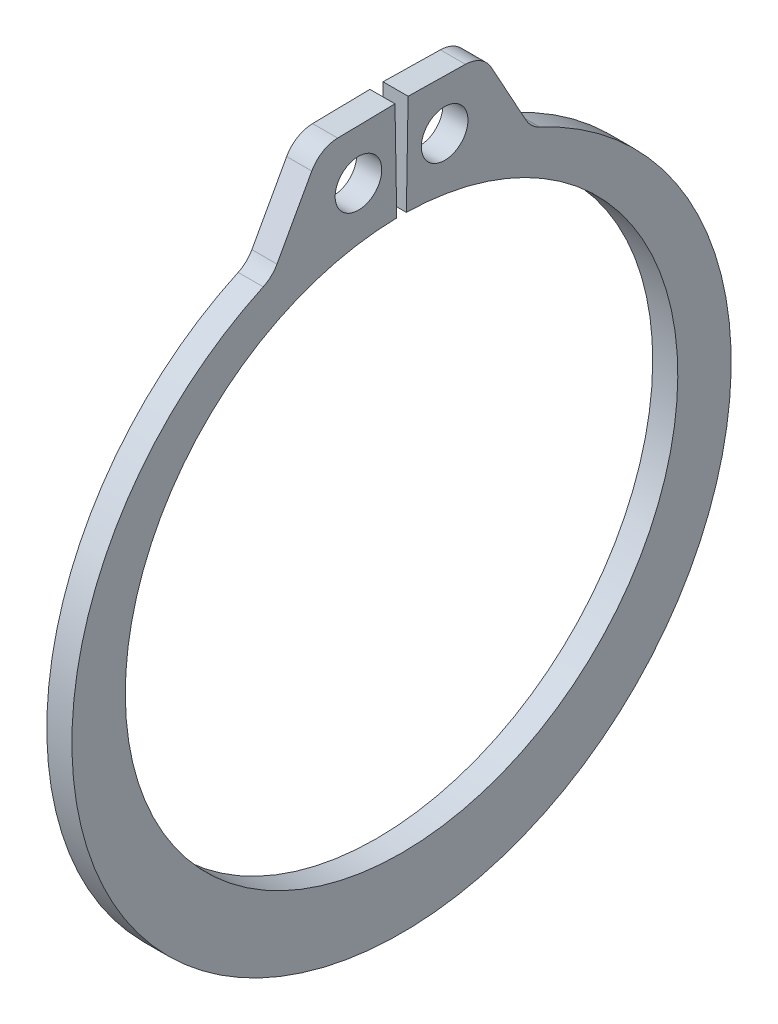
ISO-10303-21;
HEADER;
FILE_DESCRIPTION(('STEP AP214'),'2;1');
FILE_NAME('part.step','',(''),(''),'','','');
FILE_SCHEMA(('AUTOMOTIVE_DESIGN { 1 0 10303 214 1 1 1 1 }'));
ENDSEC;
DATA;
#1=APPLICATION_CONTEXT('core data for automotive mechanical design processes');
#2=APPLICATION_PROTOCOL_DEFINITION('international standard','automotive_design',2000,#1);
#3=PRODUCT_CONTEXT('',#1,'mechanical');
#4=PRODUCT('Part','Part','',(#3));
#5=PRODUCT_RELATED_PRODUCT_CATEGORY('part','',(#4));
#6=PRODUCT_DEFINITION_FORMATION('','',#4);
#7=PRODUCT_DEFINITION_CONTEXT('part definition',#1,'design');
#8=PRODUCT_DEFINITION('design','',#6,#7);
#9=PRODUCT_DEFINITION_SHAPE('','',#8);
#10=(LENGTH_UNIT() NAMED_UNIT(*) SI_UNIT(.MILLI.,.METRE.));
#11=(NAMED_UNIT(*) PLANE_ANGLE_UNIT() SI_UNIT($,.RADIAN.));
#12=(NAMED_UNIT(*) SI_UNIT($,.STERADIAN.) SOLID_ANGLE_UNIT());
#13=UNCERTAINTY_MEASURE_WITH_UNIT(LENGTH_MEASURE(1.E-05),#10,'distance_accuracy_value','');
#14=(GEOMETRIC_REPRESENTATION_CONTEXT(3) GLOBAL_UNCERTAINTY_ASSIGNED_CONTEXT((#13)) GLOBAL_UNIT_ASSIGNED_CONTEXT((#10,
#11,#12)) REPRESENTATION_CONTEXT('',''));
#15=CARTESIAN_POINT('',(0.,0.,0.));
#16=DIRECTION('',(0.,0.,1.));
#17=DIRECTION('',(1.,0.,0.));
#18=AXIS2_PLACEMENT_3D('',#15,#16,#17);
#19=CARTESIAN_POINT('',(0.5334,0.,0.));
#20=DIRECTION('',(1.,0.,0.));
#21=DIRECTION('',(0.,0.,-1.));
#22=AXIS2_PLACEMENT_3D('',#19,#20,#21);
#23=PLANE('',#22);
#24=CARTESIAN_POINT('',(0.5334,13.8385266688972,1.8324696859277));
#25=DIRECTION('',(1.,0.,0.));
#26=DIRECTION('',(0.,0.,-1.));
#27=AXIS2_PLACEMENT_3D('',#24,#25,#26);
#28=CIRCLE('',#27,0.9906);
#29=CARTESIAN_POINT('',(0.5334,13.8385266688972,0.841869685927701));
#30=VERTEX_POINT('',#29);
#31=EDGE_CURVE('E221',#30,#30,#28,.T.);
#32=ORIENTED_EDGE('',*,*,#31,.F.);
#33=EDGE_LOOP('',(#32));
#34=FACE_BOUND('',#33,.T.);
#35=DIRECTION('',(0.,-0.0174524064372829,0.999847695156391));
#36=VECTOR('',#35,1.);
#37=CARTESIAN_POINT('',(0.5334,15.9868647521641,0.279051762247657));
#38=LINE('',#37,#36);
#39=CARTESIAN_POINT('',(0.5334,15.9868647521641,0.279051762247657));
#40=VERTEX_POINT('',#39);
#41=CARTESIAN_POINT('',(0.5334,15.9443119802331,2.71689843345609));
#42=VERTEX_POINT('',#41);
#43=EDGE_CURVE('E133',#40,#42,#38,.T.);
#44=ORIENTED_EDGE('',*,*,#43,.T.);
#45=CARTESIAN_POINT('',(0.5334,14.661807341656,2.69451223171899));
#46=DIRECTION('',(1.,0.,0.));
#47=DIRECTION('',(0.,0.,-1.));
#48=AXIS2_PLACEMENT_3D('',#45,#46,#47);
#49=CIRCLE('',#48,1.2827);
#50=CARTESIAN_POINT('',(0.5334,15.2803079489985,3.81824542457083));
#51=VERTEX_POINT('',#50);
#52=EDGE_CURVE('E174',#42,#51,#49,.T.);
#53=ORIENTED_EDGE('',*,*,#52,.T.);
#54=DIRECTION('',(0.,-0.876068599712977,0.482186487364529));
#55=VECTOR('',#54,1.);
#56=CARTESIAN_POINT('',(0.5334,15.9313425389448,3.45991722723344));
#57=LINE('',#56,#55);
#58=CARTESIAN_POINT('',(0.5334,12.5932417303443,5.29720154936886));
#59=VERTEX_POINT('',#58);
#60=EDGE_CURVE('E213',#51,#59,#57,.T.);
#61=ORIENTED_EDGE('',*,*,#60,.T.);
#62=CARTESIAN_POINT('',(0.5334,13.2117423376868,6.4209347422207));
#63=DIRECTION('',(1.,0.,0.));
#64=DIRECTION('',(0.,0.,-1.));
#65=AXIS2_PLACEMENT_3D('',#62,#63,#64);
#66=CIRCLE('',#65,1.2827);
#67=CARTESIAN_POINT('',(0.5334,12.0474579195929,5.88264013535209));
#68=VERTEX_POINT('',#67);
#69=EDGE_CURVE('E181',#59,#68,#66,.F.);
#70=ORIENTED_EDGE('',*,*,#69,.T.);
#71=CARTESIAN_POINT('',(0.5334,-0.676181068147741,0.));
#72=DIRECTION('',(1.,0.,0.));
#73=DIRECTION('',(0.,0.,-1.));
#74=AXIS2_PLACEMENT_3D('',#71,#72,#73);
#75=CIRCLE('',#74,14.0177189318523);
#76=CARTESIAN_POINT('',(0.5334,12.0474579195929,-5.88264013535209));
#77=VERTEX_POINT('',#76);
#78=EDGE_CURVE('E206',#68,#77,#75,.T.);
#79=ORIENTED_EDGE('',*,*,#78,.T.);
#80=CARTESIAN_POINT('',(0.5334,13.2117423376868,-6.4209347422207));
#81=DIRECTION('',(1.,0.,0.));
#82=DIRECTION('',(0.,0.,-1.));
#83=AXIS2_PLACEMENT_3D('',#80,#81,#82);
#84=CIRCLE('',#83,1.2827);
#85=CARTESIAN_POINT('',(0.5334,12.5932417303443,-5.29720154936886));
#86=VERTEX_POINT('',#85);
#87=EDGE_CURVE('E11',#77,#86,#84,.F.);
#88=ORIENTED_EDGE('',*,*,#87,.T.);
#89=DIRECTION('',(0.,0.876068599712977,0.482186487364529));
#90=VECTOR('',#89,1.);
#91=CARTESIAN_POINT('',(0.5334,15.9313425389448,-3.45991722723344));
#92=LINE('',#91,#90);
#93=CARTESIAN_POINT('',(0.5334,15.2803079489985,-3.81824542457083));
#94=VERTEX_POINT('',#93);
#95=EDGE_CURVE('E205',#86,#94,#92,.T.);
#96=ORIENTED_EDGE('',*,*,#95,.T.);
#97=CARTESIAN_POINT('',(0.5334,14.661807341656,-2.69451223171899));
#98=DIRECTION('',(1.,0.,0.));
#99=DIRECTION('',(0.,0.,-1.));
#100=AXIS2_PLACEMENT_3D('',#97,#98,#99);
#101=CIRCLE('',#100,1.2827);
#102=CARTESIAN_POINT('',(0.5334,15.9443119802331,-2.71689843345609));
#103=VERTEX_POINT('',#102);
#104=EDGE_CURVE('E49',#94,#103,#101,.T.);
#105=ORIENTED_EDGE('',*,*,#104,.T.);
#106=DIRECTION('',(0.,0.0174524064372829,0.999847695156391));
#107=VECTOR('',#106,1.);
#108=CARTESIAN_POINT('',(0.5334,15.9868647521641,-0.279051762247657));
#109=LINE('',#108,#107);
#110=CARTESIAN_POINT('',(0.5334,15.9868647521641,-0.279051762247657));
#111=VERTEX_POINT('',#110);
#112=EDGE_CURVE('E210',#103,#111,#109,.T.);
#113=ORIENTED_EDGE('',*,*,#112,.T.);
#114=DIRECTION('',(0.,-0.999847695156391,0.0174524064372834));
#115=VECTOR('',#114,1.);
#116=CARTESIAN_POINT('',(0.5334,11.7457107988497,-0.205022144621988));
#117=LINE('',#116,#115);
#118=CARTESIAN_POINT('',(0.5334,11.7457107988497,-0.205022144621988));
#119=VERTEX_POINT('',#118);
#120=EDGE_CURVE('E139',#111,#119,#117,.T.);
#121=ORIENTED_EDGE('',*,*,#120,.T.);
#122=CARTESIAN_POINT('',(0.5334,0.,0.));
#123=DIRECTION('',(-1.,0.,0.));
#124=DIRECTION('',(0.,0.,-1.));
#125=AXIS2_PLACEMENT_3D('',#122,#123,#124);
#126=CIRCLE('',#125,11.7475);
#127=CARTESIAN_POINT('',(0.5334,11.7457107988497,0.205022144621988));
#128=VERTEX_POINT('',#127);
#129=EDGE_CURVE('E134',#119,#128,#126,.T.);
#130=ORIENTED_EDGE('',*,*,#129,.T.);
#131=DIRECTION('',(0.,0.999847695156391,0.0174524064372834));
#132=VECTOR('',#131,1.);
#133=CARTESIAN_POINT('',(0.5334,11.7457107988497,0.205022144621988));
#134=LINE('',#133,#132);
#135=EDGE_CURVE('E125',#128,#40,#134,.T.);
#136=ORIENTED_EDGE('',*,*,#135,.T.);
#137=EDGE_LOOP('',(#44,#53,#61,#70,#79,#88,#96,#105,#113,#121,#130,#136));
#138=FACE_BOUND('',#137,.T.);
#139=CARTESIAN_POINT('',(0.5334,13.8385266688972,-1.8324696859277));
#140=DIRECTION('',(1.,0.,0.));
#141=DIRECTION('',(0.,0.,-1.));
#142=AXIS2_PLACEMENT_3D('',#139,#140,#141);
#143=CIRCLE('',#142,0.9906);
#144=CARTESIAN_POINT('',(0.5334,13.8385266688972,-2.8230696859277));
#145=VERTEX_POINT('',#144);
#146=EDGE_CURVE('E247',#145,#145,#143,.T.);
#147=ORIENTED_EDGE('',*,*,#146,.F.);
#148=EDGE_LOOP('',(#147));
#149=FACE_BOUND('',#148,.T.);
#150=ADVANCED_FACE('F34',(#34,#138,#149),#23,.T.);
#151=CARTESIAN_POINT('',(-0.5334,0.,0.));
#152=DIRECTION('',(1.,0.,0.));
#153=DIRECTION('',(0.,0.,-1.));
#154=AXIS2_PLACEMENT_3D('',#151,#152,#153);
#155=PLANE('',#154);
#156=CARTESIAN_POINT('',(-0.5334,13.8385266688972,1.8324696859277));
#157=DIRECTION('',(1.,0.,0.));
#158=DIRECTION('',(0.,0.,-1.));
#159=AXIS2_PLACEMENT_3D('',#156,#157,#158);
#160=CIRCLE('',#159,0.9906);
#161=CARTESIAN_POINT('',(-0.5334,13.8385266688972,0.841869685927701));
#162=VERTEX_POINT('',#161);
#163=EDGE_CURVE('E244',#162,#162,#160,.T.);
#164=ORIENTED_EDGE('',*,*,#163,.T.);
#165=EDGE_LOOP('',(#164));
#166=FACE_BOUND('',#165,.T.);
#167=DIRECTION('',(0.,-0.876068599712977,0.482186487364529));
#168=VECTOR('',#167,1.);
#169=CARTESIAN_POINT('',(-0.5334,15.9313425389448,3.45991722723344));
#170=LINE('',#169,#168);
#171=CARTESIAN_POINT('',(-0.5334,15.2803079489985,3.81824542457083));
#172=VERTEX_POINT('',#171);
#173=CARTESIAN_POINT('',(-0.5334,12.5932417303443,5.29720154936886));
#174=VERTEX_POINT('',#173);
#175=EDGE_CURVE('E200',#172,#174,#170,.T.);
#176=ORIENTED_EDGE('',*,*,#175,.F.);
#177=CARTESIAN_POINT('',(-0.5334,14.661807341656,2.69451223171899));
#178=DIRECTION('',(1.,0.,0.));
#179=DIRECTION('',(0.,0.,-1.));
#180=AXIS2_PLACEMENT_3D('',#177,#178,#179);
#181=CIRCLE('',#180,1.2827);
#182=CARTESIAN_POINT('',(-0.5334,15.9443119802331,2.71689843345609));
#183=VERTEX_POINT('',#182);
#184=EDGE_CURVE('E170',#172,#183,#181,.F.);
#185=ORIENTED_EDGE('',*,*,#184,.T.);
#186=DIRECTION('',(0.,-0.0174524064372829,0.999847695156391));
#187=VECTOR('',#186,1.);
#188=CARTESIAN_POINT('',(-0.5334,15.9868647521641,0.279051762247657));
#189=LINE('',#188,#187);
#190=CARTESIAN_POINT('',(-0.5334,15.9868647521641,0.279051762247657));
#191=VERTEX_POINT('',#190);
#192=EDGE_CURVE('E223',#191,#183,#189,.T.);
#193=ORIENTED_EDGE('',*,*,#192,.F.);
#194=DIRECTION('',(0.,0.999847695156391,0.0174524064372834));
#195=VECTOR('',#194,1.);
#196=CARTESIAN_POINT('',(-0.5334,11.7457107988497,0.205022144621988));
#197=LINE('',#196,#195);
#198=CARTESIAN_POINT('',(-0.5334,11.7457107988497,0.205022144621988));
#199=VERTEX_POINT('',#198);
#200=EDGE_CURVE('E220',#199,#191,#197,.T.);
#201=ORIENTED_EDGE('',*,*,#200,.F.);
#202=CARTESIAN_POINT('',(-0.5334,0.,0.));
#203=DIRECTION('',(-1.,0.,0.));
#204=DIRECTION('',(0.,0.,-1.));
#205=AXIS2_PLACEMENT_3D('',#202,#203,#204);
#206=CIRCLE('',#205,11.7475);
#207=CARTESIAN_POINT('',(-0.5334,11.7457107988497,-0.205022144621988));
#208=VERTEX_POINT('',#207);
#209=EDGE_CURVE('E147',#208,#199,#206,.T.);
#210=ORIENTED_EDGE('',*,*,#209,.F.);
#211=DIRECTION('',(0.,-0.999847695156391,0.0174524064372834));
#212=VECTOR('',#211,1.);
#213=CARTESIAN_POINT('',(-0.5334,11.7457107988497,-0.205022144621988));
#214=LINE('',#213,#212);
#215=CARTESIAN_POINT('',(-0.5334,15.9868647521641,-0.279051762247657));
#216=VERTEX_POINT('',#215);
#217=EDGE_CURVE('E143',#216,#208,#214,.T.);
#218=ORIENTED_EDGE('',*,*,#217,.F.);
#219=DIRECTION('',(0.,0.0174524064372829,0.999847695156391));
#220=VECTOR('',#219,1.);
#221=CARTESIAN_POINT('',(-0.5334,15.9868647521641,-0.279051762247657));
#222=LINE('',#221,#220);
#223=CARTESIAN_POINT('',(-0.5334,15.9443119802331,-2.71689843345609));
#224=VERTEX_POINT('',#223);
#225=EDGE_CURVE('E228',#224,#216,#222,.T.);
#226=ORIENTED_EDGE('',*,*,#225,.F.);
#227=CARTESIAN_POINT('',(-0.5334,14.661807341656,-2.69451223171899));
#228=DIRECTION('',(1.,0.,0.));
#229=DIRECTION('',(0.,0.,-1.));
#230=AXIS2_PLACEMENT_3D('',#227,#228,#229);
#231=CIRCLE('',#230,1.2827);
#232=CARTESIAN_POINT('',(-0.5334,15.2803079489985,-3.81824542457083));
#233=VERTEX_POINT('',#232);
#234=EDGE_CURVE('E168',#224,#233,#231,.F.);
#235=ORIENTED_EDGE('',*,*,#234,.T.);
#236=DIRECTION('',(0.,0.876068599712977,0.482186487364529));
#237=VECTOR('',#236,1.);
#238=CARTESIAN_POINT('',(-0.5334,15.9313425389448,-3.45991722723344));
#239=LINE('',#238,#237);
#240=CARTESIAN_POINT('',(-0.5334,12.5932417303443,-5.29720154936886));
#241=VERTEX_POINT('',#240);
#242=EDGE_CURVE('E191',#241,#233,#239,.T.);
#243=ORIENTED_EDGE('',*,*,#242,.F.);
#244=CARTESIAN_POINT('',(-0.5334,13.2117423376868,-6.4209347422207));
#245=DIRECTION('',(1.,0.,0.));
#246=DIRECTION('',(0.,0.,-1.));
#247=AXIS2_PLACEMENT_3D('',#244,#245,#246);
#248=CIRCLE('',#247,1.2827);
#249=CARTESIAN_POINT('',(-0.5334,12.0474579195929,-5.88264013535209));
#250=VERTEX_POINT('',#249);
#251=EDGE_CURVE('E42',#241,#250,#248,.T.);
#252=ORIENTED_EDGE('',*,*,#251,.T.);
#253=CARTESIAN_POINT('',(-0.5334,-0.676181068147741,0.));
#254=DIRECTION('',(1.,0.,0.));
#255=DIRECTION('',(0.,0.,-1.));
#256=AXIS2_PLACEMENT_3D('',#253,#254,#255);
#257=CIRCLE('',#256,14.0177189318523);
#258=CARTESIAN_POINT('',(-0.5334,12.0474579195929,5.88264013535209));
#259=VERTEX_POINT('',#258);
#260=EDGE_CURVE('E189',#259,#250,#257,.T.);
#261=ORIENTED_EDGE('',*,*,#260,.F.);
#262=CARTESIAN_POINT('',(-0.5334,13.2117423376868,6.4209347422207));
#263=DIRECTION('',(1.,0.,0.));
#264=DIRECTION('',(0.,0.,-1.));
#265=AXIS2_PLACEMENT_3D('',#262,#263,#264);
#266=CIRCLE('',#265,1.2827);
#267=EDGE_CURVE('E179',#259,#174,#266,.T.);
#268=ORIENTED_EDGE('',*,*,#267,.T.);
#269=EDGE_LOOP('',(#176,#185,#193,#201,#210,#218,#226,#235,#243,#252,#261,#268));
#270=FACE_BOUND('',#269,.T.);
#271=CARTESIAN_POINT('',(-0.5334,13.8385266688972,-1.8324696859277));
#272=DIRECTION('',(1.,0.,0.));
#273=DIRECTION('',(0.,0.,-1.));
#274=AXIS2_PLACEMENT_3D('',#271,#272,#273);
#275=CIRCLE('',#274,0.9906);
#276=CARTESIAN_POINT('',(-0.5334,13.8385266688972,-2.8230696859277));
#277=VERTEX_POINT('',#276);
#278=EDGE_CURVE('E250',#277,#277,#275,.T.);
#279=ORIENTED_EDGE('',*,*,#278,.T.);
#280=EDGE_LOOP('',(#279));
#281=FACE_BOUND('',#280,.T.);
#282=ADVANCED_FACE('F187',(#166,#270,#281),#155,.F.);
#283=CARTESIAN_POINT('',(0.5334,0.,0.));
#284=DIRECTION('',(-1.,0.,0.));
#285=DIRECTION('',(0.,0.,1.));
#286=AXIS2_PLACEMENT_3D('',#283,#284,#285);
#287=CYLINDRICAL_SURFACE('',#286,11.7475);
#288=ORIENTED_EDGE('',*,*,#209,.T.);
#289=DIRECTION('',(-1.,0.,0.));
#290=VECTOR('',#289,1.);
#291=CARTESIAN_POINT('',(0.5334,11.7457107988497,0.205022144621988));
#292=LINE('',#291,#290);
#293=EDGE_CURVE('E129',#128,#199,#292,.T.);
#294=ORIENTED_EDGE('',*,*,#293,.F.);
#295=ORIENTED_EDGE('',*,*,#129,.F.);
#296=DIRECTION('',(-1.,0.,0.));
#297=VECTOR('',#296,1.);
#298=CARTESIAN_POINT('',(0.5334,11.7457107988497,-0.205022144621988));
#299=LINE('',#298,#297);
#300=EDGE_CURVE('E218',#119,#208,#299,.T.);
#301=ORIENTED_EDGE('',*,*,#300,.T.);
#302=EDGE_LOOP('',(#288,#294,#295,#301));
#303=FACE_BOUND('',#302,.T.);
#304=ADVANCED_FACE('F145',(#303),#287,.F.);
#305=CARTESIAN_POINT('',(0.5334,11.7457107988497,0.205022144621988));
#306=DIRECTION('',(0.,-0.0174524064372834,0.999847695156391));
#307=DIRECTION('',(0.,-0.999847695156391,-0.0174524064372834));
#308=AXIS2_PLACEMENT_3D('',#305,#306,#307);
#309=PLANE('',#308);
#310=ORIENTED_EDGE('',*,*,#200,.T.);
#311=DIRECTION('',(-1.,0.,0.));
#312=VECTOR('',#311,1.);
#313=CARTESIAN_POINT('',(0.5334,15.9868647521641,0.279051762247657));
#314=LINE('',#313,#312);
#315=EDGE_CURVE('E132',#40,#191,#314,.T.);
#316=ORIENTED_EDGE('',*,*,#315,.F.);
#317=ORIENTED_EDGE('',*,*,#135,.F.);
#318=ORIENTED_EDGE('',*,*,#293,.T.);
#319=EDGE_LOOP('',(#310,#316,#317,#318));
#320=FACE_BOUND('',#319,.T.);
#321=ADVANCED_FACE('F127',(#320),#309,.F.);
#322=CARTESIAN_POINT('',(0.5334,15.9868647521641,0.279051762247657));
#323=DIRECTION('',(0.,-0.999847695156391,-0.0174524064372829));
#324=DIRECTION('',(0.,0.0174524064372829,-0.999847695156391));
#325=AXIS2_PLACEMENT_3D('',#322,#323,#324);
#326=PLANE('',#325);
#327=ORIENTED_EDGE('',*,*,#192,.T.);
#328=DIRECTION('',(-1.,0.,0.));
#329=VECTOR('',#328,1.);
#330=CARTESIAN_POINT('',(0.5334,15.9443119802331,2.71689843345609));
#331=LINE('',#330,#329);
#332=EDGE_CURVE('E57',#183,#42,#331,.F.);
#333=ORIENTED_EDGE('',*,*,#332,.T.);
#334=ORIENTED_EDGE('',*,*,#43,.F.);
#335=ORIENTED_EDGE('',*,*,#315,.T.);
#336=EDGE_LOOP('',(#327,#333,#334,#335));
#337=FACE_BOUND('',#336,.T.);
#338=ADVANCED_FACE('F239',(#337),#326,.F.);
#339=CARTESIAN_POINT('',(0.5334,15.9313425389448,3.45991722723344));
#340=DIRECTION('',(0.,-0.482186487364529,-0.876068599712977));
#341=DIRECTION('',(0.,0.876068599712977,-0.482186487364529));
#342=AXIS2_PLACEMENT_3D('',#339,#340,#341);
#343=PLANE('',#342);
#344=ORIENTED_EDGE('',*,*,#175,.T.);
#345=DIRECTION('',(1.,0.,0.));
#346=VECTOR('',#345,1.);
#347=CARTESIAN_POINT('',(0.5334,12.5932417303443,5.29720154936886));
#348=LINE('',#347,#346);
#349=EDGE_CURVE('E161',#174,#59,#348,.T.);
#350=ORIENTED_EDGE('',*,*,#349,.T.);
#351=ORIENTED_EDGE('',*,*,#60,.F.);
#352=DIRECTION('',(-1.,0.,0.));
#353=VECTOR('',#352,1.);
#354=CARTESIAN_POINT('',(0.5334,15.2803079489985,3.81824542457083));
#355=LINE('',#354,#353);
#356=EDGE_CURVE('E158',#51,#172,#355,.T.);
#357=ORIENTED_EDGE('',*,*,#356,.T.);
#358=EDGE_LOOP('',(#344,#350,#351,#357));
#359=FACE_BOUND('',#358,.T.);
#360=ADVANCED_FACE('F280',(#359),#343,.F.);
#361=CARTESIAN_POINT('',(0.5334,-0.676181068147741,0.));
#362=DIRECTION('',(-1.,0.,0.));
#363=DIRECTION('',(0.,0.,1.));
#364=AXIS2_PLACEMENT_3D('',#361,#362,#363);
#365=CYLINDRICAL_SURFACE('',#364,14.0177189318523);
#366=ORIENTED_EDGE('',*,*,#78,.F.);
#367=DIRECTION('',(-1.,0.,0.));
#368=VECTOR('',#367,1.);
#369=CARTESIAN_POINT('',(0.5334,12.0474579195929,5.88264013535209));
#370=LINE('',#369,#368);
#371=EDGE_CURVE('E150',#68,#259,#370,.T.);
#372=ORIENTED_EDGE('',*,*,#371,.T.);
#373=ORIENTED_EDGE('',*,*,#260,.T.);
#374=DIRECTION('',(-1.,0.,0.));
#375=VECTOR('',#374,1.);
#376=CARTESIAN_POINT('',(0.5334,12.0474579195929,-5.88264013535209));
#377=LINE('',#376,#375);
#378=EDGE_CURVE('E148',#250,#77,#377,.F.);
#379=ORIENTED_EDGE('',*,*,#378,.T.);
#380=EDGE_LOOP('',(#366,#372,#373,#379));
#381=FACE_BOUND('',#380,.T.);
#382=ADVANCED_FACE('F197',(#381),#365,.T.);
#383=CARTESIAN_POINT('',(0.5334,15.9313425389448,-3.45991722723344));
#384=DIRECTION('',(0.,-0.482186487364529,0.876068599712977));
#385=DIRECTION('',(0.,-0.876068599712977,-0.482186487364529));
#386=AXIS2_PLACEMENT_3D('',#383,#384,#385);
#387=PLANE('',#386);
#388=ORIENTED_EDGE('',*,*,#95,.F.);
#389=DIRECTION('',(1.,0.,0.));
#390=VECTOR('',#389,1.);
#391=CARTESIAN_POINT('',(-0.5334,12.5932417303443,-5.29720154936886));
#392=LINE('',#391,#390);
#393=EDGE_CURVE('E165',#86,#241,#392,.F.);
#394=ORIENTED_EDGE('',*,*,#393,.T.);
#395=ORIENTED_EDGE('',*,*,#242,.T.);
#396=DIRECTION('',(-1.,0.,0.));
#397=VECTOR('',#396,1.);
#398=CARTESIAN_POINT('',(0.5334,15.2803079489985,-3.81824542457083));
#399=LINE('',#398,#397);
#400=EDGE_CURVE('E163',#233,#94,#399,.F.);
#401=ORIENTED_EDGE('',*,*,#400,.T.);
#402=EDGE_LOOP('',(#388,#394,#395,#401));
#403=FACE_BOUND('',#402,.T.);
#404=ADVANCED_FACE('F208',(#403),#387,.F.);
#405=CARTESIAN_POINT('',(0.5334,15.9868647521641,-0.279051762247657));
#406=DIRECTION('',(0.,-0.999847695156391,0.0174524064372829));
#407=DIRECTION('',(0.,-0.0174524064372829,-0.999847695156391));
#408=AXIS2_PLACEMENT_3D('',#405,#406,#407);
#409=PLANE('',#408);
#410=ORIENTED_EDGE('',*,*,#112,.F.);
#411=DIRECTION('',(-1.,0.,0.));
#412=VECTOR('',#411,1.);
#413=CARTESIAN_POINT('',(0.5334,15.9443119802331,-2.71689843345609));
#414=LINE('',#413,#412);
#415=EDGE_CURVE('E176',#103,#224,#414,.T.);
#416=ORIENTED_EDGE('',*,*,#415,.T.);
#417=ORIENTED_EDGE('',*,*,#225,.T.);
#418=DIRECTION('',(-1.,0.,0.));
#419=VECTOR('',#418,1.);
#420=CARTESIAN_POINT('',(0.5334,15.9868647521641,-0.279051762247657));
#421=LINE('',#420,#419);
#422=EDGE_CURVE('E152',#111,#216,#421,.T.);
#423=ORIENTED_EDGE('',*,*,#422,.F.);
#424=EDGE_LOOP('',(#410,#416,#417,#423));
#425=FACE_BOUND('',#424,.T.);
#426=ADVANCED_FACE('F273',(#425),#409,.F.);
#427=CARTESIAN_POINT('',(0.5334,11.7457107988497,-0.205022144621988));
#428=DIRECTION('',(0.,-0.0174524064372834,-0.999847695156391));
#429=DIRECTION('',(0.,0.999847695156391,-0.0174524064372834));
#430=AXIS2_PLACEMENT_3D('',#427,#428,#429);
#431=PLANE('',#430);
#432=ORIENTED_EDGE('',*,*,#217,.T.);
#433=ORIENTED_EDGE('',*,*,#300,.F.);
#434=ORIENTED_EDGE('',*,*,#120,.F.);
#435=ORIENTED_EDGE('',*,*,#422,.T.);
#436=EDGE_LOOP('',(#432,#433,#434,#435));
#437=FACE_BOUND('',#436,.T.);
#438=ADVANCED_FACE('F235',(#437),#431,.F.);
#439=CARTESIAN_POINT('',(0.5334,13.8385266688972,1.8324696859277));
#440=DIRECTION('',(-1.,0.,0.));
#441=DIRECTION('',(0.,0.,1.));
#442=AXIS2_PLACEMENT_3D('',#439,#440,#441);
#443=CYLINDRICAL_SURFACE('',#442,0.9906);
#444=ORIENTED_EDGE('',*,*,#31,.T.);
#445=EDGE_LOOP('',(#444));
#446=FACE_BOUND('',#445,.T.);
#447=ORIENTED_EDGE('',*,*,#163,.F.);
#448=EDGE_LOOP('',(#447));
#449=FACE_BOUND('',#448,.T.);
#450=ADVANCED_FACE('F268',(#446,#449),#443,.F.);
#451=CARTESIAN_POINT('',(0.5334,13.8385266688972,-1.8324696859277));
#452=DIRECTION('',(-1.,0.,0.));
#453=DIRECTION('',(0.,0.,1.));
#454=AXIS2_PLACEMENT_3D('',#451,#452,#453);
#455=CYLINDRICAL_SURFACE('',#454,0.9906);
#456=ORIENTED_EDGE('',*,*,#146,.T.);
#457=EDGE_LOOP('',(#456));
#458=FACE_BOUND('',#457,.T.);
#459=ORIENTED_EDGE('',*,*,#278,.F.);
#460=EDGE_LOOP('',(#459));
#461=FACE_BOUND('',#460,.T.);
#462=ADVANCED_FACE('F256',(#458,#461),#455,.F.);
#463=CARTESIAN_POINT('',(0.5334,13.2117423376868,6.4209347422207));
#464=DIRECTION('',(-1.,0.,0.));
#465=DIRECTION('',(0.,0.,1.));
#466=AXIS2_PLACEMENT_3D('',#463,#464,#465);
#467=CYLINDRICAL_SURFACE('',#466,1.2827);
#468=ORIENTED_EDGE('',*,*,#69,.F.);
#469=ORIENTED_EDGE('',*,*,#349,.F.);
#470=ORIENTED_EDGE('',*,*,#267,.F.);
#471=ORIENTED_EDGE('',*,*,#371,.F.);
#472=EDGE_LOOP('',(#468,#469,#470,#471));
#473=FACE_BOUND('',#472,.T.);
#474=ADVANCED_FACE('F290',(#473),#467,.F.);
#475=CARTESIAN_POINT('',(0.5334,13.2117423376868,-6.4209347422207));
#476=DIRECTION('',(-1.,0.,0.));
#477=DIRECTION('',(0.,0.,1.));
#478=AXIS2_PLACEMENT_3D('',#475,#476,#477);
#479=CYLINDRICAL_SURFACE('',#478,1.2827);
#480=ORIENTED_EDGE('',*,*,#87,.F.);
#481=ORIENTED_EDGE('',*,*,#378,.F.);
#482=ORIENTED_EDGE('',*,*,#251,.F.);
#483=ORIENTED_EDGE('',*,*,#393,.F.);
#484=EDGE_LOOP('',(#480,#481,#482,#483));
#485=FACE_BOUND('',#484,.T.);
#486=ADVANCED_FACE('F203',(#485),#479,.F.);
#487=CARTESIAN_POINT('',(0.5334,14.661807341656,2.69451223171899));
#488=DIRECTION('',(-1.,0.,0.));
#489=DIRECTION('',(0.,0.,1.));
#490=AXIS2_PLACEMENT_3D('',#487,#488,#489);
#491=CYLINDRICAL_SURFACE('',#490,1.2827);
#492=ORIENTED_EDGE('',*,*,#52,.F.);
#493=ORIENTED_EDGE('',*,*,#332,.F.);
#494=ORIENTED_EDGE('',*,*,#184,.F.);
#495=ORIENTED_EDGE('',*,*,#356,.F.);
#496=EDGE_LOOP('',(#492,#493,#494,#495));
#497=FACE_BOUND('',#496,.T.);
#498=ADVANCED_FACE('F295',(#497),#491,.T.);
#499=CARTESIAN_POINT('',(0.5334,14.661807341656,-2.69451223171899));
#500=DIRECTION('',(-1.,0.,0.));
#501=DIRECTION('',(0.,0.,1.));
#502=AXIS2_PLACEMENT_3D('',#499,#500,#501);
#503=CYLINDRICAL_SURFACE('',#502,1.2827);
#504=ORIENTED_EDGE('',*,*,#104,.F.);
#505=ORIENTED_EDGE('',*,*,#400,.F.);
#506=ORIENTED_EDGE('',*,*,#234,.F.);
#507=ORIENTED_EDGE('',*,*,#415,.F.);
#508=EDGE_LOOP('',(#504,#505,#506,#507));
#509=FACE_BOUND('',#508,.T.);
#510=ADVANCED_FACE('F36',(#509),#503,.T.);
#511=CLOSED_SHELL('',(#150,#282,#304,#321,#338,#360,#382,#404,#426,#438,#450,#462,#474,#486,
#498,#510));
#512=MANIFOLD_SOLID_BREP('B2',#511);
#513=ADVANCED_BREP_SHAPE_REPRESENTATION('',(#18,#512),#14);
#514=SHAPE_DEFINITION_REPRESENTATION(#9,#513);
ENDSEC;
END-ISO-10303-21;
